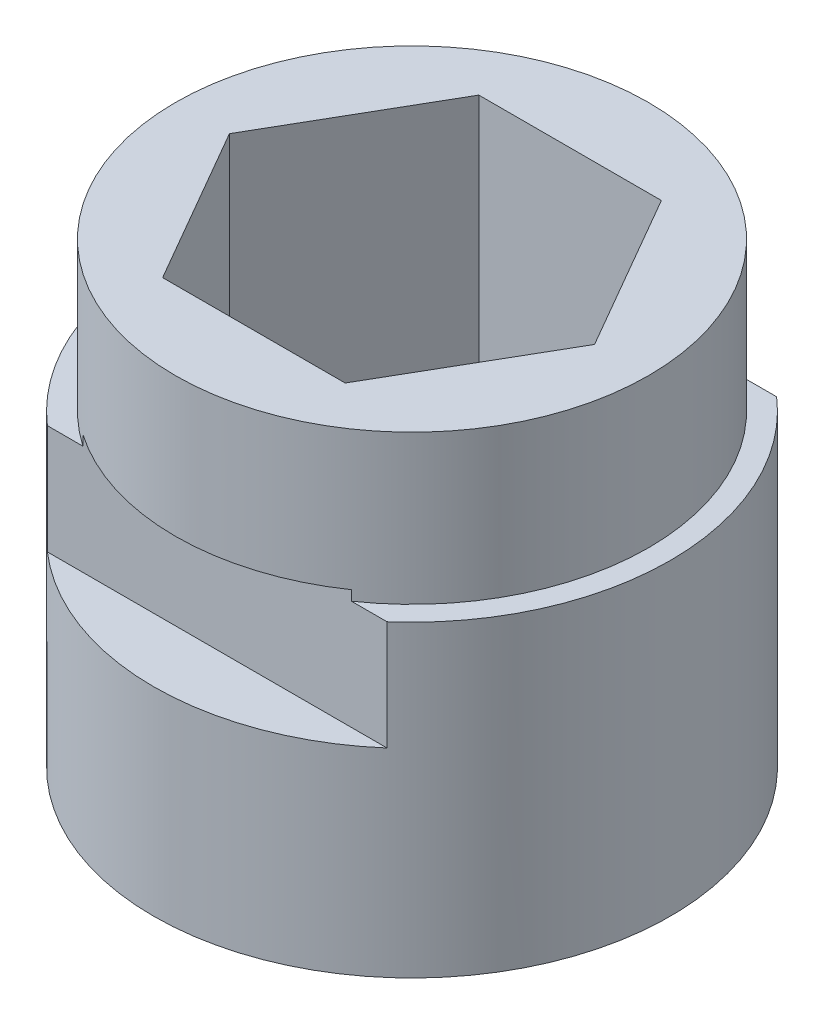
ISO-10303-21;
HEADER;
FILE_DESCRIPTION(('STEP AP214'),'2;1');
FILE_NAME('part.step','',(''),(''),'','','');
FILE_SCHEMA(('AUTOMOTIVE_DESIGN { 1 0 10303 214 1 1 1 1 }'));
ENDSEC;
DATA;
#1=APPLICATION_CONTEXT('core data for automotive mechanical design processes');
#2=APPLICATION_PROTOCOL_DEFINITION('international standard','automotive_design',2000,#1);
#3=PRODUCT_CONTEXT('',#1,'mechanical');
#4=PRODUCT('Part','Part','',(#3));
#5=PRODUCT_RELATED_PRODUCT_CATEGORY('part','',(#4));
#6=PRODUCT_DEFINITION_FORMATION('','',#4);
#7=PRODUCT_DEFINITION_CONTEXT('part definition',#1,'design');
#8=PRODUCT_DEFINITION('design','',#6,#7);
#9=PRODUCT_DEFINITION_SHAPE('','',#8);
#10=(LENGTH_UNIT() NAMED_UNIT(*) SI_UNIT(.MILLI.,.METRE.));
#11=(NAMED_UNIT(*) PLANE_ANGLE_UNIT() SI_UNIT($,.RADIAN.));
#12=(NAMED_UNIT(*) SI_UNIT($,.STERADIAN.) SOLID_ANGLE_UNIT());
#13=UNCERTAINTY_MEASURE_WITH_UNIT(LENGTH_MEASURE(1.E-05),#10,'distance_accuracy_value','');
#14=(GEOMETRIC_REPRESENTATION_CONTEXT(3) GLOBAL_UNCERTAINTY_ASSIGNED_CONTEXT((#13)) GLOBAL_UNIT_ASSIGNED_CONTEXT((#10,
#11,#12)) REPRESENTATION_CONTEXT('',''));
#15=CARTESIAN_POINT('',(0.,0.,0.));
#16=DIRECTION('',(0.,0.,1.));
#17=DIRECTION('',(1.,0.,0.));
#18=AXIS2_PLACEMENT_3D('',#15,#16,#17);
#19=CARTESIAN_POINT('',(0.,9.2075,0.));
#20=DIRECTION('',(0.,-1.,0.));
#21=DIRECTION('',(0.,0.,-1.));
#22=AXIS2_PLACEMENT_3D('',#19,#20,#21);
#23=PLANE('',#22);
#24=CARTESIAN_POINT('',(0.,9.2075,0.));
#25=DIRECTION('',(0.,-1.,0.));
#26=DIRECTION('',(0.,0.,-1.));
#27=AXIS2_PLACEMENT_3D('',#24,#25,#26);
#28=CIRCLE('',#27,8.255);
#29=CARTESIAN_POINT('',(-5.42395575203191,9.2075,6.223));
#30=VERTEX_POINT('',#29);
#31=CARTESIAN_POINT('',(-5.42395575203191,9.2075,-6.223));
#32=VERTEX_POINT('',#31);
#33=EDGE_CURVE('E167',#30,#32,#28,.T.);
#34=ORIENTED_EDGE('',*,*,#33,.F.);
#35=DIRECTION('',(1.,0.,0.));
#36=VECTOR('',#35,1.);
#37=CARTESIAN_POINT('',(0.,9.2075,6.223));
#38=LINE('',#37,#36);
#39=CARTESIAN_POINT('',(-4.28660276326137,9.2075,6.223));
#40=VERTEX_POINT('',#39);
#41=EDGE_CURVE('E154',#30,#40,#38,.T.);
#42=ORIENTED_EDGE('',*,*,#41,.T.);
#43=CARTESIAN_POINT('',(0.,9.2075,0.));
#44=DIRECTION('',(0.,-1.,0.));
#45=DIRECTION('',(0.,0.,-1.));
#46=AXIS2_PLACEMENT_3D('',#43,#44,#45);
#47=CIRCLE('',#46,7.5565);
#48=CARTESIAN_POINT('',(-4.28660276326137,9.2075,-6.223));
#49=VERTEX_POINT('',#48);
#50=EDGE_CURVE('E281',#40,#49,#47,.T.);
#51=ORIENTED_EDGE('',*,*,#50,.T.);
#52=DIRECTION('',(-1.,0.,0.));
#53=VECTOR('',#52,1.);
#54=CARTESIAN_POINT('',(0.,9.2075,-6.223));
#55=LINE('',#54,#53);
#56=EDGE_CURVE('E286',#49,#32,#55,.T.);
#57=ORIENTED_EDGE('',*,*,#56,.T.);
#58=EDGE_LOOP('',(#34,#42,#51,#57));
#59=FACE_BOUND('',#58,.T.);
#60=ADVANCED_FACE('F43',(#59),#23,.F.);
#61=CARTESIAN_POINT('',(0.,13.97,0.));
#62=DIRECTION('',(0.,-1.,0.));
#63=DIRECTION('',(0.,0.,-1.));
#64=AXIS2_PLACEMENT_3D('',#61,#62,#63);
#65=CYLINDRICAL_SURFACE('',#64,7.5565);
#66=CARTESIAN_POINT('',(0.,13.97,0.));
#67=DIRECTION('',(0.,1.,0.));
#68=DIRECTION('',(0.,0.,1.));
#69=AXIS2_PLACEMENT_3D('',#66,#67,#68);
#70=CIRCLE('',#69,7.5565);
#71=CARTESIAN_POINT('',(0.,13.97,7.5565));
#72=VERTEX_POINT('',#71);
#73=EDGE_CURVE('E277',#72,#72,#70,.T.);
#74=ORIENTED_EDGE('',*,*,#73,.F.);
#75=EDGE_LOOP('',(#74));
#76=FACE_BOUND('',#75,.T.);
#77=CARTESIAN_POINT('',(0.,9.525,0.));
#78=DIRECTION('',(0.,1.,0.));
#79=DIRECTION('',(0.,0.,1.));
#80=AXIS2_PLACEMENT_3D('',#77,#78,#79);
#81=CIRCLE('',#80,7.5565);
#82=CARTESIAN_POINT('',(-4.28660276326137,9.525,6.223));
#83=VERTEX_POINT('',#82);
#84=CARTESIAN_POINT('',(4.28660276326137,9.525,6.223));
#85=VERTEX_POINT('',#84);
#86=EDGE_CURVE('E11',#83,#85,#81,.T.);
#87=ORIENTED_EDGE('',*,*,#86,.T.);
#88=DIRECTION('',(0.,-1.,0.));
#89=VECTOR('',#88,1.);
#90=CARTESIAN_POINT('',(4.28660276326137,13.97,6.223));
#91=LINE('',#90,#89);
#92=CARTESIAN_POINT('',(4.28660276326137,9.2075,6.223));
#93=VERTEX_POINT('',#92);
#94=EDGE_CURVE('E188',#85,#93,#91,.T.);
#95=ORIENTED_EDGE('',*,*,#94,.T.);
#96=CARTESIAN_POINT('',(4.28660276326137,9.2075,-6.223));
#97=VERTEX_POINT('',#96);
#98=EDGE_CURVE('E282',#97,#93,#47,.T.);
#99=ORIENTED_EDGE('',*,*,#98,.F.);
#100=DIRECTION('',(0.,-1.,0.));
#101=VECTOR('',#100,1.);
#102=CARTESIAN_POINT('',(4.28660276326137,13.97,-6.223));
#103=LINE('',#102,#101);
#104=CARTESIAN_POINT('',(4.28660276326137,9.525,-6.223));
#105=VERTEX_POINT('',#104);
#106=EDGE_CURVE('E182',#97,#105,#103,.F.);
#107=ORIENTED_EDGE('',*,*,#106,.T.);
#108=CARTESIAN_POINT('',(0.,9.525,0.));
#109=DIRECTION('',(0.,1.,0.));
#110=DIRECTION('',(0.,0.,1.));
#111=AXIS2_PLACEMENT_3D('',#108,#109,#110);
#112=CIRCLE('',#111,7.5565);
#113=CARTESIAN_POINT('',(-4.28660276326137,9.525,-6.223));
#114=VERTEX_POINT('',#113);
#115=EDGE_CURVE('E52',#105,#114,#112,.T.);
#116=ORIENTED_EDGE('',*,*,#115,.T.);
#117=DIRECTION('',(0.,-1.,0.));
#118=VECTOR('',#117,1.);
#119=CARTESIAN_POINT('',(-4.28660276326137,13.97,-6.223));
#120=LINE('',#119,#118);
#121=EDGE_CURVE('E169',#114,#49,#120,.T.);
#122=ORIENTED_EDGE('',*,*,#121,.T.);
#123=ORIENTED_EDGE('',*,*,#50,.F.);
#124=DIRECTION('',(0.,-1.,0.));
#125=VECTOR('',#124,1.);
#126=CARTESIAN_POINT('',(-4.28660276326137,13.97,6.223));
#127=LINE('',#126,#125);
#128=EDGE_CURVE('E195',#40,#83,#127,.F.);
#129=ORIENTED_EDGE('',*,*,#128,.T.);
#130=EDGE_LOOP('',(#87,#95,#99,#107,#116,#122,#123,#129));
#131=FACE_BOUND('',#130,.T.);
#132=ADVANCED_FACE('F45',(#76,#131),#65,.T.);
#133=CARTESIAN_POINT('',(0.,13.97,0.));
#134=DIRECTION('',(0.,1.,0.));
#135=DIRECTION('',(0.,0.,1.));
#136=AXIS2_PLACEMENT_3D('',#133,#134,#135);
#137=PLANE('',#136);
#138=ORIENTED_EDGE('',*,*,#73,.T.);
#139=EDGE_LOOP('',(#138));
#140=FACE_BOUND('',#139,.T.);
#141=DIRECTION('',(-0.5,0.,0.866025403784439));
#142=VECTOR('',#141,1.);
#143=CARTESIAN_POINT('',(-2.91561885940761,13.97,-5.05));
#144=LINE('',#143,#142);
#145=CARTESIAN_POINT('',(-2.91561885940761,13.97,-5.05));
#146=VERTEX_POINT('',#145);
#147=CARTESIAN_POINT('',(-5.83123771881522,13.97,0.));
#148=VERTEX_POINT('',#147);
#149=EDGE_CURVE('E219',#146,#148,#144,.T.);
#150=ORIENTED_EDGE('',*,*,#149,.F.);
#151=DIRECTION('',(-1.,0.,0.));
#152=VECTOR('',#151,1.);
#153=CARTESIAN_POINT('',(2.91561885940761,13.97,-5.05));
#154=LINE('',#153,#152);
#155=CARTESIAN_POINT('',(2.91561885940761,13.97,-5.05));
#156=VERTEX_POINT('',#155);
#157=EDGE_CURVE('E216',#156,#146,#154,.T.);
#158=ORIENTED_EDGE('',*,*,#157,.F.);
#159=DIRECTION('',(-0.5,0.,-0.866025403784439));
#160=VECTOR('',#159,1.);
#161=CARTESIAN_POINT('',(5.83123771881522,13.97,0.));
#162=LINE('',#161,#160);
#163=CARTESIAN_POINT('',(5.83123771881522,13.97,0.));
#164=VERTEX_POINT('',#163);
#165=EDGE_CURVE('E233',#164,#156,#162,.T.);
#166=ORIENTED_EDGE('',*,*,#165,.F.);
#167=DIRECTION('',(0.5,0.,-0.866025403784439));
#168=VECTOR('',#167,1.);
#169=CARTESIAN_POINT('',(2.91561885940761,13.97,5.05));
#170=LINE('',#169,#168);
#171=CARTESIAN_POINT('',(2.91561885940761,13.97,5.05));
#172=VERTEX_POINT('',#171);
#173=EDGE_CURVE('E229',#172,#164,#170,.T.);
#174=ORIENTED_EDGE('',*,*,#173,.F.);
#175=DIRECTION('',(1.,0.,0.));
#176=VECTOR('',#175,1.);
#177=CARTESIAN_POINT('',(-2.91561885940761,13.97,5.05));
#178=LINE('',#177,#176);
#179=CARTESIAN_POINT('',(-2.91561885940761,13.97,5.05));
#180=VERTEX_POINT('',#179);
#181=EDGE_CURVE('E226',#180,#172,#178,.T.);
#182=ORIENTED_EDGE('',*,*,#181,.F.);
#183=DIRECTION('',(0.5,0.,0.866025403784439));
#184=VECTOR('',#183,1.);
#185=CARTESIAN_POINT('',(-5.83123771881522,13.97,0.));
#186=LINE('',#185,#184);
#187=EDGE_CURVE('E223',#148,#180,#186,.T.);
#188=ORIENTED_EDGE('',*,*,#187,.F.);
#189=EDGE_LOOP('',(#150,#158,#166,#174,#182,#188));
#190=FACE_BOUND('',#189,.T.);
#191=ADVANCED_FACE('F329',(#140,#190),#137,.T.);
#192=CARTESIAN_POINT('',(2.91561885940761,13.97,-5.05));
#193=DIRECTION('',(0.,0.,1.));
#194=DIRECTION('',(1.,0.,0.));
#195=AXIS2_PLACEMENT_3D('',#192,#193,#194);
#196=PLANE('',#195);
#197=DIRECTION('',(-1.,0.,0.));
#198=VECTOR('',#197,1.);
#199=CARTESIAN_POINT('',(2.91561885940761,0.,-5.05));
#200=LINE('',#199,#198);
#201=CARTESIAN_POINT('',(2.91561885940761,0.,-5.05));
#202=VERTEX_POINT('',#201);
#203=CARTESIAN_POINT('',(-2.91561885940761,0.,-5.05));
#204=VERTEX_POINT('',#203);
#205=EDGE_CURVE('E212',#202,#204,#200,.T.);
#206=ORIENTED_EDGE('',*,*,#205,.F.);
#207=DIRECTION('',(0.,-1.,0.));
#208=VECTOR('',#207,1.);
#209=CARTESIAN_POINT('',(2.91561885940761,13.97,-5.05));
#210=LINE('',#209,#208);
#211=EDGE_CURVE('E236',#156,#202,#210,.T.);
#212=ORIENTED_EDGE('',*,*,#211,.F.);
#213=ORIENTED_EDGE('',*,*,#157,.T.);
#214=DIRECTION('',(0.,-1.,0.));
#215=VECTOR('',#214,1.);
#216=CARTESIAN_POINT('',(-2.91561885940761,13.97,-5.05));
#217=LINE('',#216,#215);
#218=EDGE_CURVE('E273',#146,#204,#217,.T.);
#219=ORIENTED_EDGE('',*,*,#218,.T.);
#220=EDGE_LOOP('',(#206,#212,#213,#219));
#221=FACE_BOUND('',#220,.T.);
#222=ADVANCED_FACE('F372',(#221),#196,.T.);
#223=CARTESIAN_POINT('',(-2.91561885940761,13.97,-5.05));
#224=DIRECTION('',(0.866025403784438,0.,0.5));
#225=DIRECTION('',(0.5,0.,-0.866025403784439));
#226=AXIS2_PLACEMENT_3D('',#223,#224,#225);
#227=PLANE('',#226);
#228=DIRECTION('',(-0.5,0.,0.866025403784439));
#229=VECTOR('',#228,1.);
#230=CARTESIAN_POINT('',(-2.91561885940761,0.,-5.05));
#231=LINE('',#230,#229);
#232=CARTESIAN_POINT('',(-5.83123771881522,0.,0.));
#233=VERTEX_POINT('',#232);
#234=EDGE_CURVE('E240',#204,#233,#231,.T.);
#235=ORIENTED_EDGE('',*,*,#234,.F.);
#236=ORIENTED_EDGE('',*,*,#218,.F.);
#237=ORIENTED_EDGE('',*,*,#149,.T.);
#238=DIRECTION('',(0.,-1.,0.));
#239=VECTOR('',#238,1.);
#240=CARTESIAN_POINT('',(-5.83123771881522,13.97,0.));
#241=LINE('',#240,#239);
#242=EDGE_CURVE('E270',#148,#233,#241,.T.);
#243=ORIENTED_EDGE('',*,*,#242,.T.);
#244=EDGE_LOOP('',(#235,#236,#237,#243));
#245=FACE_BOUND('',#244,.T.);
#246=ADVANCED_FACE('F368',(#245),#227,.T.);
#247=CARTESIAN_POINT('',(-5.83123771881522,13.97,0.));
#248=DIRECTION('',(0.866025403784439,0.,-0.5));
#249=DIRECTION('',(-0.5,0.,-0.866025403784439));
#250=AXIS2_PLACEMENT_3D('',#247,#248,#249);
#251=PLANE('',#250);
#252=DIRECTION('',(0.5,0.,0.866025403784439));
#253=VECTOR('',#252,1.);
#254=CARTESIAN_POINT('',(-5.83123771881522,0.,0.));
#255=LINE('',#254,#253);
#256=CARTESIAN_POINT('',(-2.91561885940761,0.,5.05));
#257=VERTEX_POINT('',#256);
#258=EDGE_CURVE('E244',#233,#257,#255,.T.);
#259=ORIENTED_EDGE('',*,*,#258,.F.);
#260=ORIENTED_EDGE('',*,*,#242,.F.);
#261=ORIENTED_EDGE('',*,*,#187,.T.);
#262=DIRECTION('',(0.,-1.,0.));
#263=VECTOR('',#262,1.);
#264=CARTESIAN_POINT('',(-2.91561885940761,13.97,5.05));
#265=LINE('',#264,#263);
#266=EDGE_CURVE('E267',#180,#257,#265,.T.);
#267=ORIENTED_EDGE('',*,*,#266,.T.);
#268=EDGE_LOOP('',(#259,#260,#261,#267));
#269=FACE_BOUND('',#268,.T.);
#270=ADVANCED_FACE('F364',(#269),#251,.T.);
#271=CARTESIAN_POINT('',(-2.91561885940761,13.97,5.05));
#272=DIRECTION('',(0.,0.,-1.));
#273=DIRECTION('',(-1.,0.,0.));
#274=AXIS2_PLACEMENT_3D('',#271,#272,#273);
#275=PLANE('',#274);
#276=DIRECTION('',(1.,0.,0.));
#277=VECTOR('',#276,1.);
#278=CARTESIAN_POINT('',(-2.91561885940761,0.,5.05));
#279=LINE('',#278,#277);
#280=CARTESIAN_POINT('',(2.91561885940761,0.,5.05));
#281=VERTEX_POINT('',#280);
#282=EDGE_CURVE('E248',#257,#281,#279,.T.);
#283=ORIENTED_EDGE('',*,*,#282,.F.);
#284=ORIENTED_EDGE('',*,*,#266,.F.);
#285=ORIENTED_EDGE('',*,*,#181,.T.);
#286=DIRECTION('',(0.,-1.,0.));
#287=VECTOR('',#286,1.);
#288=CARTESIAN_POINT('',(2.91561885940761,13.97,5.05));
#289=LINE('',#288,#287);
#290=EDGE_CURVE('E264',#172,#281,#289,.T.);
#291=ORIENTED_EDGE('',*,*,#290,.T.);
#292=EDGE_LOOP('',(#283,#284,#285,#291));
#293=FACE_BOUND('',#292,.T.);
#294=ADVANCED_FACE('F360',(#293),#275,.T.);
#295=CARTESIAN_POINT('',(2.91561885940761,13.97,5.05));
#296=DIRECTION('',(-0.866025403784439,0.,-0.5));
#297=DIRECTION('',(-0.5,0.,0.866025403784439));
#298=AXIS2_PLACEMENT_3D('',#295,#296,#297);
#299=PLANE('',#298);
#300=DIRECTION('',(0.5,0.,-0.866025403784439));
#301=VECTOR('',#300,1.);
#302=CARTESIAN_POINT('',(2.91561885940761,0.,5.05));
#303=LINE('',#302,#301);
#304=CARTESIAN_POINT('',(5.83123771881522,0.,0.));
#305=VERTEX_POINT('',#304);
#306=EDGE_CURVE('E252',#281,#305,#303,.T.);
#307=ORIENTED_EDGE('',*,*,#306,.F.);
#308=ORIENTED_EDGE('',*,*,#290,.F.);
#309=ORIENTED_EDGE('',*,*,#173,.T.);
#310=DIRECTION('',(0.,-1.,0.));
#311=VECTOR('',#310,1.);
#312=CARTESIAN_POINT('',(5.83123771881522,13.97,0.));
#313=LINE('',#312,#311);
#314=EDGE_CURVE('E261',#164,#305,#313,.T.);
#315=ORIENTED_EDGE('',*,*,#314,.T.);
#316=EDGE_LOOP('',(#307,#308,#309,#315));
#317=FACE_BOUND('',#316,.T.);
#318=ADVANCED_FACE('F356',(#317),#299,.T.);
#319=CARTESIAN_POINT('',(5.83123771881522,13.97,0.));
#320=DIRECTION('',(-0.866025403784439,0.,0.5));
#321=DIRECTION('',(0.5,0.,0.866025403784439));
#322=AXIS2_PLACEMENT_3D('',#319,#320,#321);
#323=PLANE('',#322);
#324=DIRECTION('',(-0.5,0.,-0.866025403784439));
#325=VECTOR('',#324,1.);
#326=CARTESIAN_POINT('',(5.83123771881522,0.,0.));
#327=LINE('',#326,#325);
#328=EDGE_CURVE('E220',#305,#202,#327,.T.);
#329=ORIENTED_EDGE('',*,*,#328,.F.);
#330=ORIENTED_EDGE('',*,*,#314,.F.);
#331=ORIENTED_EDGE('',*,*,#165,.T.);
#332=ORIENTED_EDGE('',*,*,#211,.T.);
#333=EDGE_LOOP('',(#329,#330,#331,#332));
#334=FACE_BOUND('',#333,.T.);
#335=ADVANCED_FACE('F352',(#334),#323,.T.);
#336=CARTESIAN_POINT('',(0.,0.,0.));
#337=DIRECTION('',(0.,-1.,0.));
#338=DIRECTION('',(0.,0.,-1.));
#339=AXIS2_PLACEMENT_3D('',#336,#337,#338);
#340=PLANE('',#339);
#341=CARTESIAN_POINT('',(0.,0.,0.));
#342=DIRECTION('',(0.,-1.,0.));
#343=DIRECTION('',(0.,0.,-1.));
#344=AXIS2_PLACEMENT_3D('',#341,#342,#343);
#345=CIRCLE('',#344,3.3);
#346=CARTESIAN_POINT('',(0.,0.,-3.3));
#347=VERTEX_POINT('',#346);
#348=EDGE_CURVE('E204',#347,#347,#345,.T.);
#349=ORIENTED_EDGE('',*,*,#348,.T.);
#350=EDGE_LOOP('',(#349));
#351=FACE_BOUND('',#350,.T.);
#352=ORIENTED_EDGE('',*,*,#328,.T.);
#353=ORIENTED_EDGE('',*,*,#205,.T.);
#354=ORIENTED_EDGE('',*,*,#234,.T.);
#355=ORIENTED_EDGE('',*,*,#258,.T.);
#356=ORIENTED_EDGE('',*,*,#282,.T.);
#357=ORIENTED_EDGE('',*,*,#306,.T.);
#358=EDGE_LOOP('',(#352,#353,#354,#355,#356,#357));
#359=FACE_BOUND('',#358,.T.);
#360=ADVANCED_FACE('F348',(#351,#359),#340,.F.);
#361=CARTESIAN_POINT('',(0.,-0.635,0.));
#362=DIRECTION('',(0.,-1.,0.));
#363=DIRECTION('',(0.,0.,-1.));
#364=AXIS2_PLACEMENT_3D('',#361,#362,#363);
#365=PLANE('',#364);
#366=CARTESIAN_POINT('',(0.,-0.635,0.));
#367=DIRECTION('',(0.,-1.,0.));
#368=DIRECTION('',(0.,0.,-1.));
#369=AXIS2_PLACEMENT_3D('',#366,#367,#368);
#370=CIRCLE('',#369,3.3);
#371=CARTESIAN_POINT('',(0.,-0.635,-3.3));
#372=VERTEX_POINT('',#371);
#373=EDGE_CURVE('E208',#372,#372,#370,.T.);
#374=ORIENTED_EDGE('',*,*,#373,.F.);
#375=EDGE_LOOP('',(#374));
#376=FACE_BOUND('',#375,.T.);
#377=CARTESIAN_POINT('',(0.,-0.635,0.));
#378=DIRECTION('',(0.,-1.,0.));
#379=DIRECTION('',(0.,0.,-1.));
#380=AXIS2_PLACEMENT_3D('',#377,#378,#379);
#381=CIRCLE('',#380,8.255);
#382=CARTESIAN_POINT('',(0.,-0.635,-8.255));
#383=VERTEX_POINT('',#382);
#384=EDGE_CURVE('E199',#383,#383,#381,.T.);
#385=ORIENTED_EDGE('',*,*,#384,.T.);
#386=EDGE_LOOP('',(#385));
#387=FACE_BOUND('',#386,.T.);
#388=ADVANCED_FACE('F342',(#376,#387),#365,.T.);
#389=CARTESIAN_POINT('',(0.,-0.635,0.));
#390=DIRECTION('',(0.,1.,0.));
#391=DIRECTION('',(0.,0.,1.));
#392=AXIS2_PLACEMENT_3D('',#389,#390,#391);
#393=CYLINDRICAL_SURFACE('',#392,3.3);
#394=ORIENTED_EDGE('',*,*,#373,.T.);
#395=EDGE_LOOP('',(#394));
#396=FACE_BOUND('',#395,.T.);
#397=ORIENTED_EDGE('',*,*,#348,.F.);
#398=EDGE_LOOP('',(#397));
#399=FACE_BOUND('',#398,.T.);
#400=ADVANCED_FACE('F338',(#396,#399),#393,.F.);
#401=CARTESIAN_POINT('',(0.,9.2075,0.));
#402=DIRECTION('',(0.,-1.,0.));
#403=DIRECTION('',(0.,0.,-1.));
#404=AXIS2_PLACEMENT_3D('',#401,#402,#403);
#405=CYLINDRICAL_SURFACE('',#404,8.255);
#406=DIRECTION('',(0.,-1.,0.));
#407=VECTOR('',#406,1.);
#408=CARTESIAN_POINT('',(5.42395575203191,9.2075,6.223));
#409=LINE('',#408,#407);
#410=CARTESIAN_POINT('',(5.42395575203191,5.715,6.223));
#411=VERTEX_POINT('',#410);
#412=CARTESIAN_POINT('',(5.42395575203191,9.2075,6.223));
#413=VERTEX_POINT('',#412);
#414=EDGE_CURVE('E67',#411,#413,#409,.F.);
#415=ORIENTED_EDGE('',*,*,#414,.F.);
#416=CARTESIAN_POINT('',(0.,5.715,0.));
#417=DIRECTION('',(0.,-1.,0.));
#418=DIRECTION('',(0.,0.,-1.));
#419=AXIS2_PLACEMENT_3D('',#416,#417,#418);
#420=CIRCLE('',#419,8.255);
#421=CARTESIAN_POINT('',(-5.42395575203191,5.715,6.223));
#422=VERTEX_POINT('',#421);
#423=EDGE_CURVE('E153',#422,#411,#420,.F.);
#424=ORIENTED_EDGE('',*,*,#423,.F.);
#425=DIRECTION('',(0.,-1.,0.));
#426=VECTOR('',#425,1.);
#427=CARTESIAN_POINT('',(-5.42395575203191,9.2075,6.223));
#428=LINE('',#427,#426);
#429=EDGE_CURVE('E192',#30,#422,#428,.T.);
#430=ORIENTED_EDGE('',*,*,#429,.F.);
#431=ORIENTED_EDGE('',*,*,#33,.T.);
#432=DIRECTION('',(0.,-1.,0.));
#433=VECTOR('',#432,1.);
#434=CARTESIAN_POINT('',(-5.42395575203191,9.2075,-6.223));
#435=LINE('',#434,#433);
#436=CARTESIAN_POINT('',(-5.42395575203191,5.715,-6.223));
#437=VERTEX_POINT('',#436);
#438=EDGE_CURVE('E59',#437,#32,#435,.F.);
#439=ORIENTED_EDGE('',*,*,#438,.F.);
#440=CARTESIAN_POINT('',(0.,5.715,0.));
#441=DIRECTION('',(0.,-1.,0.));
#442=DIRECTION('',(0.,0.,-1.));
#443=AXIS2_PLACEMENT_3D('',#440,#441,#442);
#444=CIRCLE('',#443,8.255);
#445=CARTESIAN_POINT('',(5.42395575203191,5.715,-6.223));
#446=VERTEX_POINT('',#445);
#447=EDGE_CURVE('E147',#446,#437,#444,.F.);
#448=ORIENTED_EDGE('',*,*,#447,.F.);
#449=DIRECTION('',(0.,-1.,0.));
#450=VECTOR('',#449,1.);
#451=CARTESIAN_POINT('',(5.42395575203191,9.2075,-6.223));
#452=LINE('',#451,#450);
#453=CARTESIAN_POINT('',(5.42395575203191,9.2075,-6.223));
#454=VERTEX_POINT('',#453);
#455=EDGE_CURVE('E157',#454,#446,#452,.T.);
#456=ORIENTED_EDGE('',*,*,#455,.F.);
#457=EDGE_CURVE('E200',#454,#413,#28,.T.);
#458=ORIENTED_EDGE('',*,*,#457,.T.);
#459=EDGE_LOOP('',(#415,#424,#430,#431,#439,#448,#456,#458));
#460=FACE_BOUND('',#459,.T.);
#461=ORIENTED_EDGE('',*,*,#384,.F.);
#462=EDGE_LOOP('',(#461));
#463=FACE_BOUND('',#462,.T.);
#464=ADVANCED_FACE('F163',(#460,#463),#405,.T.);
#465=ORIENTED_EDGE('',*,*,#98,.T.);
#466=EDGE_CURVE('E290',#93,#413,#38,.T.);
#467=ORIENTED_EDGE('',*,*,#466,.T.);
#468=ORIENTED_EDGE('',*,*,#457,.F.);
#469=EDGE_CURVE('E289',#454,#97,#55,.T.);
#470=ORIENTED_EDGE('',*,*,#469,.T.);
#471=EDGE_LOOP('',(#465,#467,#468,#470));
#472=FACE_BOUND('',#471,.T.);
#473=ADVANCED_FACE('F314',(#472),#23,.F.);
#474=CARTESIAN_POINT('',(-8.255,9.525,-6.223));
#475=DIRECTION('',(0.,1.,0.));
#476=DIRECTION('',(0.,0.,1.));
#477=AXIS2_PLACEMENT_3D('',#474,#475,#476);
#478=PLANE('',#477);
#479=DIRECTION('',(1.,0.,0.));
#480=VECTOR('',#479,1.);
#481=CARTESIAN_POINT('',(-8.255,9.525,-6.223));
#482=LINE('',#481,#480);
#483=EDGE_CURVE('E160',#114,#105,#482,.T.);
#484=ORIENTED_EDGE('',*,*,#483,.F.);
#485=ORIENTED_EDGE('',*,*,#115,.F.);
#486=EDGE_LOOP('',(#484,#485));
#487=FACE_BOUND('',#486,.T.);
#488=ADVANCED_FACE('F303',(#487),#478,.F.);
#489=CARTESIAN_POINT('',(-8.255,9.525,-6.223));
#490=DIRECTION('',(0.,0.,1.));
#491=DIRECTION('',(0.,-1.,0.));
#492=AXIS2_PLACEMENT_3D('',#489,#490,#491);
#493=PLANE('',#492);
#494=ORIENTED_EDGE('',*,*,#469,.F.);
#495=ORIENTED_EDGE('',*,*,#455,.T.);
#496=DIRECTION('',(1.,0.,0.));
#497=VECTOR('',#496,1.);
#498=CARTESIAN_POINT('',(-8.255,5.715,-6.223));
#499=LINE('',#498,#497);
#500=EDGE_CURVE('E149',#437,#446,#499,.T.);
#501=ORIENTED_EDGE('',*,*,#500,.F.);
#502=ORIENTED_EDGE('',*,*,#438,.T.);
#503=ORIENTED_EDGE('',*,*,#56,.F.);
#504=ORIENTED_EDGE('',*,*,#121,.F.);
#505=ORIENTED_EDGE('',*,*,#483,.T.);
#506=ORIENTED_EDGE('',*,*,#106,.F.);
#507=EDGE_LOOP('',(#494,#495,#501,#502,#503,#504,#505,#506));
#508=FACE_BOUND('',#507,.T.);
#509=ADVANCED_FACE('F156',(#508),#493,.F.);
#510=CARTESIAN_POINT('',(-8.255,5.715,-8.47905548205234));
#511=DIRECTION('',(0.,-1.,0.));
#512=DIRECTION('',(0.,0.,-1.));
#513=AXIS2_PLACEMENT_3D('',#510,#511,#512);
#514=PLANE('',#513);
#515=ORIENTED_EDGE('',*,*,#447,.T.);
#516=ORIENTED_EDGE('',*,*,#500,.T.);
#517=EDGE_LOOP('',(#515,#516));
#518=FACE_BOUND('',#517,.T.);
#519=ADVANCED_FACE('F148',(#518),#514,.F.);
#520=CARTESIAN_POINT('',(-8.255,9.525,6.223));
#521=DIRECTION('',(0.,1.,0.));
#522=DIRECTION('',(0.,0.,1.));
#523=AXIS2_PLACEMENT_3D('',#520,#521,#522);
#524=PLANE('',#523);
#525=DIRECTION('',(1.,0.,0.));
#526=VECTOR('',#525,1.);
#527=CARTESIAN_POINT('',(-8.255,9.525,6.223));
#528=LINE('',#527,#526);
#529=EDGE_CURVE('E170',#83,#85,#528,.T.);
#530=ORIENTED_EDGE('',*,*,#529,.T.);
#531=ORIENTED_EDGE('',*,*,#86,.F.);
#532=EDGE_LOOP('',(#530,#531));
#533=FACE_BOUND('',#532,.T.);
#534=ADVANCED_FACE('F317',(#533),#524,.F.);
#535=CARTESIAN_POINT('',(-8.255,9.525,6.223));
#536=DIRECTION('',(0.,0.,-1.));
#537=DIRECTION('',(0.,1.,0.));
#538=AXIS2_PLACEMENT_3D('',#535,#536,#537);
#539=PLANE('',#538);
#540=ORIENTED_EDGE('',*,*,#41,.F.);
#541=ORIENTED_EDGE('',*,*,#429,.T.);
#542=DIRECTION('',(1.,0.,0.));
#543=VECTOR('',#542,1.);
#544=CARTESIAN_POINT('',(-8.255,5.715,6.223));
#545=LINE('',#544,#543);
#546=EDGE_CURVE('E159',#422,#411,#545,.T.);
#547=ORIENTED_EDGE('',*,*,#546,.T.);
#548=ORIENTED_EDGE('',*,*,#414,.T.);
#549=ORIENTED_EDGE('',*,*,#466,.F.);
#550=ORIENTED_EDGE('',*,*,#94,.F.);
#551=ORIENTED_EDGE('',*,*,#529,.F.);
#552=ORIENTED_EDGE('',*,*,#128,.F.);
#553=EDGE_LOOP('',(#540,#541,#547,#548,#549,#550,#551,#552));
#554=FACE_BOUND('',#553,.T.);
#555=ADVANCED_FACE('F309',(#554),#539,.F.);
#556=CARTESIAN_POINT('',(-8.255,5.715,8.36363303247651));
#557=DIRECTION('',(0.,-1.,0.));
#558=DIRECTION('',(0.,0.,-1.));
#559=AXIS2_PLACEMENT_3D('',#556,#557,#558);
#560=PLANE('',#559);
#561=ORIENTED_EDGE('',*,*,#423,.T.);
#562=ORIENTED_EDGE('',*,*,#546,.F.);
#563=EDGE_LOOP('',(#561,#562));
#564=FACE_BOUND('',#563,.T.);
#565=ADVANCED_FACE('F515',(#564),#560,.F.);
#566=CLOSED_SHELL('',(#60,#132,#191,#222,#246,#270,#294,#318,#335,#360,#388,#400,#464,#473,#488,
#509,#519,#534,#555,#565));
#567=MANIFOLD_SOLID_BREP('B2',#566);
#568=ADVANCED_BREP_SHAPE_REPRESENTATION('',(#18,#567),#14);
#569=SHAPE_DEFINITION_REPRESENTATION(#9,#568);
ENDSEC;
END-ISO-10303-21;
